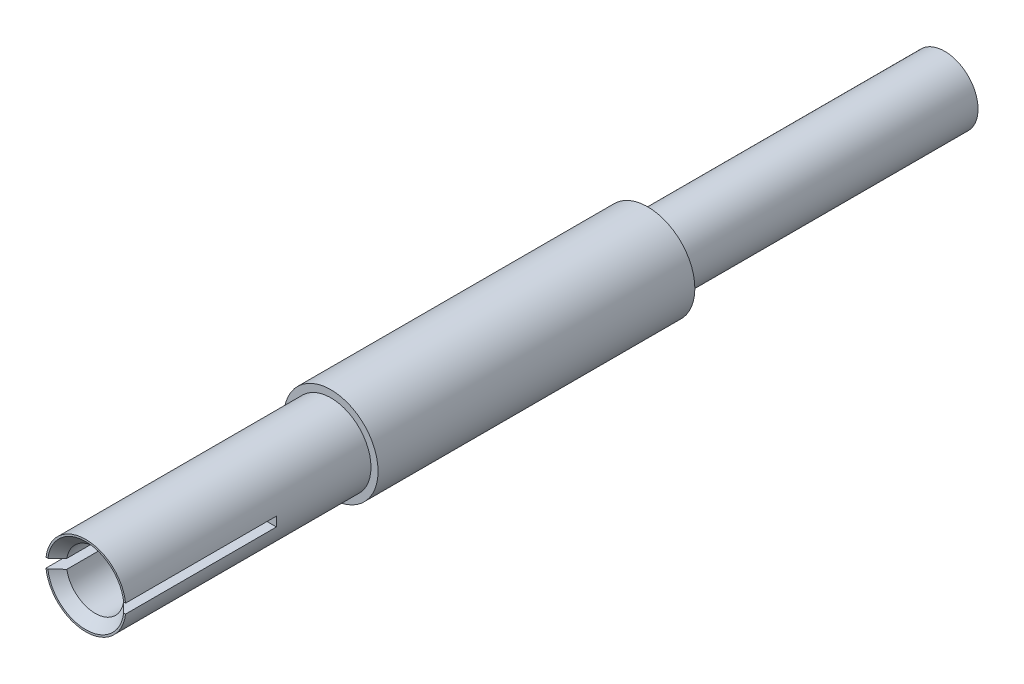
ISO-10303-21;
HEADER;
FILE_DESCRIPTION(('STEP AP214'),'2;1');
FILE_NAME('part.step','',(''),(''),'','','');
FILE_SCHEMA(('AUTOMOTIVE_DESIGN { 1 0 10303 214 1 1 1 1 }'));
ENDSEC;
DATA;
#1=APPLICATION_CONTEXT('core data for automotive mechanical design processes');
#2=APPLICATION_PROTOCOL_DEFINITION('international standard','automotive_design',2000,#1);
#3=PRODUCT_CONTEXT('',#1,'mechanical');
#4=PRODUCT('Part','Part','',(#3));
#5=PRODUCT_RELATED_PRODUCT_CATEGORY('part','',(#4));
#6=PRODUCT_DEFINITION_FORMATION('','',#4);
#7=PRODUCT_DEFINITION_CONTEXT('part definition',#1,'design');
#8=PRODUCT_DEFINITION('design','',#6,#7);
#9=PRODUCT_DEFINITION_SHAPE('','',#8);
#10=(LENGTH_UNIT() NAMED_UNIT(*) SI_UNIT(.MILLI.,.METRE.));
#11=(NAMED_UNIT(*) PLANE_ANGLE_UNIT() SI_UNIT($,.RADIAN.));
#12=(NAMED_UNIT(*) SI_UNIT($,.STERADIAN.) SOLID_ANGLE_UNIT());
#13=UNCERTAINTY_MEASURE_WITH_UNIT(LENGTH_MEASURE(1.E-05),#10,'distance_accuracy_value','');
#14=(GEOMETRIC_REPRESENTATION_CONTEXT(3) GLOBAL_UNCERTAINTY_ASSIGNED_CONTEXT((#13)) GLOBAL_UNIT_ASSIGNED_CONTEXT((#10,
#11,#12)) REPRESENTATION_CONTEXT('',''));
#15=CARTESIAN_POINT('',(0.,0.,0.));
#16=DIRECTION('',(0.,0.,1.));
#17=DIRECTION('',(1.,0.,0.));
#18=AXIS2_PLACEMENT_3D('',#15,#16,#17);
#19=CARTESIAN_POINT('',(0.,0.,3.14859999991768));
#20=DIRECTION('',(0.,0.,1.));
#21=DIRECTION('',(1.,0.,0.));
#22=AXIS2_PLACEMENT_3D('',#19,#20,#21);
#23=CONICAL_SURFACE('',#22,0.387349999925845,1.02974425864067);
#24=CARTESIAN_POINT('',(0.,0.,3.1486));
#25=DIRECTION('',(0.,0.,-1.));
#26=DIRECTION('',(-1.,0.,0.));
#27=AXIS2_PLACEMENT_3D('',#24,#25,#26);
#28=CIRCLE('',#27,0.38735);
#29=CARTESIAN_POINT('',(-0.38735,0.,3.1486));
#30=VERTEX_POINT('',#29);
#31=EDGE_CURVE('E195',#30,#30,#28,.F.);
#32=ORIENTED_EDGE('',*,*,#31,.T.);
#33=EDGE_LOOP('',(#32));
#34=FACE_BOUND('',#33,.T.);
#35=CARTESIAN_POINT('',(0.,0.,2.91585663916294));
#36=VERTEX_POINT('',#35);
#37=VERTEX_LOOP('',#36);
#38=FACE_BOUND('',#37,.T.);
#39=ADVANCED_FACE('F16',(#34,#38),#23,.F.);
#40=CARTESIAN_POINT('',(0.,0.,6.06959999998935));
#41=DIRECTION('',(0.,0.,1.));
#42=DIRECTION('',(1.,0.,0.));
#43=AXIS2_PLACEMENT_3D('',#40,#41,#42);
#44=CONICAL_SURFACE('',#43,0.514349999940683,0.78539816355156);
#45=CARTESIAN_POINT('',(0.,0.,6.06959999998935));
#46=DIRECTION('',(0.,0.,1.));
#47=DIRECTION('',(1.,0.,0.));
#48=AXIS2_PLACEMENT_3D('',#45,#46,#47);
#49=CIRCLE('',#48,0.514349999940684);
#50=CARTESIAN_POINT('',(0.510415196142739,-0.063499999999995,6.06960000000339));
#51=VERTEX_POINT('',#50);
#52=CARTESIAN_POINT('',(-0.510415196142731,-0.0635,6.06960000000339));
#53=VERTEX_POINT('',#52);
#54=EDGE_CURVE('E154',#51,#53,#49,.F.);
#55=ORIENTED_EDGE('',*,*,#54,.F.);
#56=CARTESIAN_POINT('',(0.382109634107777,-0.0635000000213032,5.94260000003275));
#57=CARTESIAN_POINT('',(0.403524698985026,-0.0635000000106516,5.96373554868005));
#58=CARTESIAN_POINT('',(0.424924362390731,-0.0635000000035505,5.98488665712628));
#59=CARTESIAN_POINT('',(0.467692883069179,-0.0634999999964495,6.02721999045916));
#60=CARTESIAN_POINT('',(0.489061740346517,-0.0634999999964495,6.04840221534116));
#61=CARTESIAN_POINT('',(0.510415196156905,-0.0635,6.06960000001745));
#62=B_SPLINE_CURVE_WITH_KNOTS('',3,(#56,#57,#58,#59,#60,#61),.UNSPECIFIED.,.F.,.F.,(4,2,4),(0.,
0.090265357925583,0.180530702386348),.UNSPECIFIED.);
#63=CARTESIAN_POINT('',(0.38210963411573,-0.0635,5.94260000002312));
#64=VERTEX_POINT('',#63);
#65=EDGE_CURVE('E162',#64,#51,#62,.T.);
#66=ORIENTED_EDGE('',*,*,#65,.F.);
#67=CARTESIAN_POINT('',(0.,0.,5.9426));
#68=DIRECTION('',(0.,0.,-1.));
#69=DIRECTION('',(-1.,0.,0.));
#70=AXIS2_PLACEMENT_3D('',#67,#68,#69);
#71=CIRCLE('',#70,0.38735);
#72=CARTESIAN_POINT('',(-0.382109634136795,-0.0635,5.94260000004411));
#73=VERTEX_POINT('',#72);
#74=EDGE_CURVE('E199',#64,#73,#71,.T.);
#75=ORIENTED_EDGE('',*,*,#74,.T.);
#76=CARTESIAN_POINT('',(-0.510415196162834,-0.0635000000092229,6.06960000001144));
#77=CARTESIAN_POINT('',(-0.489061740351425,-0.0635000000046114,6.04840221533564));
#78=CARTESIAN_POINT('',(-0.467692883071837,-0.0635000000015371,6.02721999045537));
#79=CARTESIAN_POINT('',(-0.424924362386421,-0.0634999999984629,5.98488665712845));
#80=CARTESIAN_POINT('',(-0.403524698975999,-0.0634999999984629,5.96373554868645));
#81=CARTESIAN_POINT('',(-0.382109634092802,-0.0635,5.94260000004462));
#82=B_SPLINE_CURVE_WITH_KNOTS('',3,(#76,#77,#78,#79,#80,#81),.UNSPECIFIED.,.F.,.F.,(4,2,4),(0.,
0.0902653444618959,0.180530702388632),.UNSPECIFIED.);
#83=EDGE_CURVE('E146',#53,#73,#82,.T.);
#84=ORIENTED_EDGE('',*,*,#83,.F.);
#85=EDGE_LOOP('',(#55,#66,#75,#84));
#86=FACE_BOUND('',#85,.T.);
#87=ADVANCED_FACE('F156',(#86),#44,.F.);
#88=CARTESIAN_POINT('',(0.,0.,6.0696));
#89=DIRECTION('',(0.,0.,-1.));
#90=DIRECTION('',(-1.,0.,0.));
#91=AXIS2_PLACEMENT_3D('',#88,#89,#90);
#92=CYLINDRICAL_SURFACE('',#91,0.38735);
#93=ORIENTED_EDGE('',*,*,#31,.F.);
#94=EDGE_LOOP('',(#93));
#95=FACE_BOUND('',#94,.T.);
#96=CARTESIAN_POINT('',(0.,0.,4.0376));
#97=DIRECTION('',(0.,0.,-1.));
#98=DIRECTION('',(-1.,0.,0.));
#99=AXIS2_PLACEMENT_3D('',#96,#97,#98);
#100=CIRCLE('',#99,0.38735);
#101=CARTESIAN_POINT('',(0.382109634136796,0.0634999999999999,4.0376));
#102=VERTEX_POINT('',#101);
#103=CARTESIAN_POINT('',(0.382109634136796,-0.0635000000000002,4.0376));
#104=VERTEX_POINT('',#103);
#105=EDGE_CURVE('E169',#102,#104,#100,.T.);
#106=ORIENTED_EDGE('',*,*,#105,.F.);
#107=DIRECTION('',(0.,0.,-1.));
#108=VECTOR('',#107,1.);
#109=CARTESIAN_POINT('',(0.382109634137,0.0635,6.0696));
#110=LINE('',#109,#108);
#111=CARTESIAN_POINT('',(0.382109634132592,0.0635,5.94260000008697));
#112=VERTEX_POINT('',#111);
#113=EDGE_CURVE('E186',#112,#102,#110,.T.);
#114=ORIENTED_EDGE('',*,*,#113,.F.);
#115=CARTESIAN_POINT('',(0.,0.,5.94260000008262));
#116=DIRECTION('',(0.,0.,1.));
#117=DIRECTION('',(0.986471238258404,0.163934426185997,0.));
#118=AXIS2_PLACEMENT_3D('',#115,#116,#117);
#119=CIRCLE('',#118,0.387349999991702);
#120=CARTESIAN_POINT('',(-0.382109634126001,0.0635,5.94260000007612));
#121=VERTEX_POINT('',#120);
#122=EDGE_CURVE('E102',#112,#121,#119,.T.);
#123=ORIENTED_EDGE('',*,*,#122,.T.);
#124=DIRECTION('',(0.,0.,-1.));
#125=VECTOR('',#124,1.);
#126=CARTESIAN_POINT('',(-0.382109634137,0.0635,6.0696));
#127=LINE('',#126,#125);
#128=CARTESIAN_POINT('',(-0.382109634136796,0.0634999999999998,4.0376));
#129=VERTEX_POINT('',#128);
#130=EDGE_CURVE('E114',#129,#121,#127,.F.);
#131=ORIENTED_EDGE('',*,*,#130,.F.);
#132=CARTESIAN_POINT('',(0.,0.,4.0376));
#133=DIRECTION('',(0.,0.,-1.));
#134=DIRECTION('',(-1.,0.,0.));
#135=AXIS2_PLACEMENT_3D('',#132,#133,#134);
#136=CIRCLE('',#135,0.38735);
#137=CARTESIAN_POINT('',(-0.382109634136795,-0.0635000000000001,4.0376));
#138=VERTEX_POINT('',#137);
#139=EDGE_CURVE('E110',#138,#129,#136,.T.);
#140=ORIENTED_EDGE('',*,*,#139,.F.);
#141=DIRECTION('',(0.,0.,1.));
#142=VECTOR('',#141,1.);
#143=CARTESIAN_POINT('',(-0.382109634137,-0.0635,6.0696));
#144=LINE('',#143,#142);
#145=EDGE_CURVE('E152',#73,#138,#144,.F.);
#146=ORIENTED_EDGE('',*,*,#145,.F.);
#147=ORIENTED_EDGE('',*,*,#74,.F.);
#148=DIRECTION('',(0.,0.,1.));
#149=VECTOR('',#148,1.);
#150=CARTESIAN_POINT('',(0.382109634137,-0.0635,6.0696));
#151=LINE('',#150,#149);
#152=EDGE_CURVE('E168',#104,#64,#151,.T.);
#153=ORIENTED_EDGE('',*,*,#152,.F.);
#154=EDGE_LOOP('',(#106,#114,#123,#131,#140,#146,#147,#153));
#155=FACE_BOUND('',#154,.T.);
#156=ADVANCED_FACE('F159',(#95,#155),#92,.F.);
#157=CARTESIAN_POINT('',(0.,0.,6.06960000004619));
#158=DIRECTION('',(0.,0.,1.));
#159=DIRECTION('',(0.,-1.,0.));
#160=AXIS2_PLACEMENT_3D('',#157,#158,#159);
#161=CONICAL_SURFACE('',#160,0.51434999999442,0.78539816355156);
#162=CARTESIAN_POINT('',(0.,0.,6.06960000004619));
#163=DIRECTION('',(0.,0.,1.));
#164=DIRECTION('',(0.,-1.,0.));
#165=AXIS2_PLACEMENT_3D('',#162,#163,#164);
#166=CIRCLE('',#165,0.514349999994419);
#167=CARTESIAN_POINT('',(-0.510415196159456,0.0635,6.0696000000231));
#168=VERTEX_POINT('',#167);
#169=CARTESIAN_POINT('',(0.510415196174565,0.0635,6.06960000003808));
#170=VERTEX_POINT('',#169);
#171=EDGE_CURVE('E19',#168,#170,#166,.F.);
#172=ORIENTED_EDGE('',*,*,#171,.F.);
#173=CARTESIAN_POINT('',(-0.382109634122112,0.0635000000113739,5.94260000006242));
#174=CARTESIAN_POINT('',(-0.403524699001302,0.0635000000056869,5.96373554870546));
#175=CARTESIAN_POINT('',(-0.424924362407916,0.0635000000018957,5.98488665714846));
#176=CARTESIAN_POINT('',(-0.467692883086116,0.0634999999981044,6.02721999047699));
#177=CARTESIAN_POINT('',(-0.489061740362296,0.0634999999981044,6.04840221535786));
#178=CARTESIAN_POINT('',(-0.510415196170496,0.0635,6.06960000003405));
#179=B_SPLINE_CURVE_WITH_KNOTS('',3,(#173,#174,#175,#176,#177,#178),.UNSPECIFIED.,.F.,.F.,(4,2,
4),(0.,0.0902653579207298,0.180530702376633),.UNSPECIFIED.);
#180=EDGE_CURVE('E95',#121,#168,#179,.T.);
#181=ORIENTED_EDGE('',*,*,#180,.F.);
#182=ORIENTED_EDGE('',*,*,#122,.F.);
#183=CARTESIAN_POINT('',(0.510415196173183,0.0635000000105243,6.06960000002313));
#184=CARTESIAN_POINT('',(0.489061740361113,0.0635000000052622,6.04840221534751));
#185=CARTESIAN_POINT('',(0.467692883081003,0.0635000000017541,6.02721999046727));
#186=CARTESIAN_POINT('',(0.424924362394825,0.0634999999982459,5.98488665714014));
#187=CARTESIAN_POINT('',(0.403524698984162,0.0634999999982459,5.96373554869789));
#188=CARTESIAN_POINT('',(0.382109634100865,0.0635,5.94260000005567));
#189=B_SPLINE_CURVE_WITH_KNOTS('',3,(#183,#184,#185,#186,#187,#188),.UNSPECIFIED.,.F.,.F.,(4,2,
4),(0.,0.0902653444629319,0.180530702390704),.UNSPECIFIED.);
#190=EDGE_CURVE('E98',#170,#112,#189,.T.);
#191=ORIENTED_EDGE('',*,*,#190,.F.);
#192=EDGE_LOOP('',(#172,#181,#182,#191));
#193=FACE_BOUND('',#192,.T.);
#194=ADVANCED_FACE('F93',(#193),#161,.F.);
#195=CARTESIAN_POINT('',(0.,0.,6.0696));
#196=DIRECTION('',(0.,0.,1.));
#197=DIRECTION('',(1.,0.,0.));
#198=AXIS2_PLACEMENT_3D('',#195,#196,#197);
#199=PLANE('',#198);
#200=DIRECTION('',(1.,0.,0.));
#201=VECTOR('',#200,1.);
#202=CARTESIAN_POINT('',(-0.635,0.0635,6.0696));
#203=LINE('',#202,#201);
#204=CARTESIAN_POINT('',(-0.536001690762257,0.0635000000000151,6.0696));
#205=VERTEX_POINT('',#204);
#206=EDGE_CURVE('E104',#168,#205,#203,.F.);
#207=ORIENTED_EDGE('',*,*,#206,.F.);
#208=ORIENTED_EDGE('',*,*,#171,.T.);
#209=DIRECTION('',(1.,0.,0.));
#210=VECTOR('',#209,1.);
#211=CARTESIAN_POINT('',(-0.635,0.0635,6.0696));
#212=LINE('',#211,#210);
#213=CARTESIAN_POINT('',(0.536001690762258,0.0635000000000102,6.0696));
#214=VERTEX_POINT('',#213);
#215=EDGE_CURVE('E101',#214,#170,#212,.F.);
#216=ORIENTED_EDGE('',*,*,#215,.F.);
#217=CARTESIAN_POINT('',(0.,0.,6.0696));
#218=DIRECTION('',(0.,0.,1.));
#219=DIRECTION('',(1.,0.,0.));
#220=AXIS2_PLACEMENT_3D('',#217,#218,#219);
#221=CIRCLE('',#220,0.53975);
#222=EDGE_CURVE('E107',#205,#214,#221,.F.);
#223=ORIENTED_EDGE('',*,*,#222,.F.);
#224=EDGE_LOOP('',(#207,#208,#216,#223));
#225=FACE_BOUND('',#224,.T.);
#226=ADVANCED_FACE('F105',(#225),#199,.T.);
#227=CARTESIAN_POINT('',(-0.635,0.0635,6.0696));
#228=DIRECTION('',(0.,-1.,0.));
#229=DIRECTION('',(0.,0.,-1.));
#230=AXIS2_PLACEMENT_3D('',#227,#228,#229);
#231=PLANE('',#230);
#232=DIRECTION('',(1.,0.,0.));
#233=VECTOR('',#232,1.);
#234=CARTESIAN_POINT('',(0.,0.0635,4.0376));
#235=LINE('',#234,#233);
#236=CARTESIAN_POINT('',(0.536001690762257,0.0635000000000101,4.0376));
#237=VERTEX_POINT('',#236);
#238=EDGE_CURVE('E188',#237,#102,#235,.F.);
#239=ORIENTED_EDGE('',*,*,#238,.F.);
#240=DIRECTION('',(0.,0.,1.));
#241=VECTOR('',#240,1.);
#242=CARTESIAN_POINT('',(0.536001690762255,0.0635000000000202,2.7676));
#243=LINE('',#242,#241);
#244=EDGE_CURVE('E116',#214,#237,#243,.F.);
#245=ORIENTED_EDGE('',*,*,#244,.F.);
#246=ORIENTED_EDGE('',*,*,#215,.T.);
#247=ORIENTED_EDGE('',*,*,#190,.T.);
#248=ORIENTED_EDGE('',*,*,#113,.T.);
#249=EDGE_LOOP('',(#239,#245,#246,#247,#248));
#250=FACE_BOUND('',#249,.T.);
#251=ADVANCED_FACE('F178',(#250),#231,.T.);
#252=CARTESIAN_POINT('',(0.,0.,4.0376));
#253=DIRECTION('',(0.,0.,1.));
#254=DIRECTION('',(1.,0.,0.));
#255=AXIS2_PLACEMENT_3D('',#252,#253,#254);
#256=PLANE('',#255);
#257=CARTESIAN_POINT('',(0.,0.,4.0376));
#258=DIRECTION('',(0.,0.,1.));
#259=DIRECTION('',(1.,0.,0.));
#260=AXIS2_PLACEMENT_3D('',#257,#258,#259);
#261=CIRCLE('',#260,0.53975);
#262=CARTESIAN_POINT('',(0.536001690762256,-0.0635000000000152,4.0376));
#263=VERTEX_POINT('',#262);
#264=EDGE_CURVE('E225',#237,#263,#261,.F.);
#265=ORIENTED_EDGE('',*,*,#264,.F.);
#266=ORIENTED_EDGE('',*,*,#238,.T.);
#267=ORIENTED_EDGE('',*,*,#105,.T.);
#268=DIRECTION('',(1.,0.,0.));
#269=VECTOR('',#268,1.);
#270=CARTESIAN_POINT('',(0.635,-0.0635000000000002,4.0376));
#271=LINE('',#270,#269);
#272=EDGE_CURVE('E204',#263,#104,#271,.F.);
#273=ORIENTED_EDGE('',*,*,#272,.F.);
#274=EDGE_LOOP('',(#265,#266,#267,#273));
#275=FACE_BOUND('',#274,.T.);
#276=ADVANCED_FACE('F174',(#275),#256,.T.);
#277=CARTESIAN_POINT('',(0.635,-0.0635,6.0696));
#278=DIRECTION('',(0.,1.,0.));
#279=DIRECTION('',(0.,0.,1.));
#280=AXIS2_PLACEMENT_3D('',#277,#278,#279);
#281=PLANE('',#280);
#282=ORIENTED_EDGE('',*,*,#152,.T.);
#283=ORIENTED_EDGE('',*,*,#65,.T.);
#284=DIRECTION('',(1.,0.,0.));
#285=VECTOR('',#284,1.);
#286=CARTESIAN_POINT('',(0.,-0.06349999999999,6.0696));
#287=LINE('',#286,#285);
#288=CARTESIAN_POINT('',(0.536001690762258,-0.0635000000000101,6.0696));
#289=VERTEX_POINT('',#288);
#290=EDGE_CURVE('E167',#289,#51,#287,.F.);
#291=ORIENTED_EDGE('',*,*,#290,.F.);
#292=DIRECTION('',(0.,0.,1.));
#293=VECTOR('',#292,1.);
#294=CARTESIAN_POINT('',(0.536001690762254,-0.0635000000000303,2.7676));
#295=LINE('',#294,#293);
#296=EDGE_CURVE('E224',#263,#289,#295,.T.);
#297=ORIENTED_EDGE('',*,*,#296,.F.);
#298=ORIENTED_EDGE('',*,*,#272,.T.);
#299=EDGE_LOOP('',(#282,#283,#291,#297,#298));
#300=FACE_BOUND('',#299,.T.);
#301=ADVANCED_FACE('F170',(#300),#281,.T.);
#302=CARTESIAN_POINT('',(0.,0.,6.0696));
#303=DIRECTION('',(0.,0.,1.));
#304=DIRECTION('',(1.,0.,0.));
#305=AXIS2_PLACEMENT_3D('',#302,#303,#304);
#306=PLANE('',#305);
#307=ORIENTED_EDGE('',*,*,#290,.T.);
#308=ORIENTED_EDGE('',*,*,#54,.T.);
#309=DIRECTION('',(1.,0.,0.));
#310=VECTOR('',#309,1.);
#311=CARTESIAN_POINT('',(0.635,-0.0635,6.0696));
#312=LINE('',#311,#310);
#313=CARTESIAN_POINT('',(-0.536001690762258,-0.0635000000000051,6.0696));
#314=VERTEX_POINT('',#313);
#315=EDGE_CURVE('E153',#314,#53,#312,.T.);
#316=ORIENTED_EDGE('',*,*,#315,.F.);
#317=CARTESIAN_POINT('',(0.,0.,6.0696));
#318=DIRECTION('',(0.,0.,1.));
#319=DIRECTION('',(1.,0.,0.));
#320=AXIS2_PLACEMENT_3D('',#317,#318,#319);
#321=CIRCLE('',#320,0.53975);
#322=EDGE_CURVE('E222',#289,#314,#321,.F.);
#323=ORIENTED_EDGE('',*,*,#322,.F.);
#324=EDGE_LOOP('',(#307,#308,#316,#323));
#325=FACE_BOUND('',#324,.T.);
#326=ADVANCED_FACE('F143',(#325),#306,.T.);
#327=CARTESIAN_POINT('',(0.635,-0.0635,6.0696));
#328=DIRECTION('',(0.,1.,0.));
#329=DIRECTION('',(0.,0.,1.));
#330=AXIS2_PLACEMENT_3D('',#327,#328,#329);
#331=PLANE('',#330);
#332=DIRECTION('',(1.,0.,0.));
#333=VECTOR('',#332,1.);
#334=CARTESIAN_POINT('',(0.,-0.0635,4.0376));
#335=LINE('',#334,#333);
#336=CARTESIAN_POINT('',(-0.536001690762259,-0.0635000000000052,4.0376));
#337=VERTEX_POINT('',#336);
#338=EDGE_CURVE('E201',#337,#138,#335,.T.);
#339=ORIENTED_EDGE('',*,*,#338,.F.);
#340=DIRECTION('',(0.,0.,1.));
#341=VECTOR('',#340,1.);
#342=CARTESIAN_POINT('',(-0.536001690762258,-0.0635000000000104,2.7676));
#343=LINE('',#342,#341);
#344=EDGE_CURVE('E221',#314,#337,#343,.F.);
#345=ORIENTED_EDGE('',*,*,#344,.F.);
#346=ORIENTED_EDGE('',*,*,#315,.T.);
#347=ORIENTED_EDGE('',*,*,#83,.T.);
#348=ORIENTED_EDGE('',*,*,#145,.T.);
#349=EDGE_LOOP('',(#339,#345,#346,#347,#348));
#350=FACE_BOUND('',#349,.T.);
#351=ADVANCED_FACE('F139',(#350),#331,.T.);
#352=CARTESIAN_POINT('',(0.,0.,4.0376));
#353=DIRECTION('',(0.,0.,1.));
#354=DIRECTION('',(1.,0.,0.));
#355=AXIS2_PLACEMENT_3D('',#352,#353,#354);
#356=PLANE('',#355);
#357=ORIENTED_EDGE('',*,*,#338,.T.);
#358=ORIENTED_EDGE('',*,*,#139,.T.);
#359=DIRECTION('',(1.,0.,0.));
#360=VECTOR('',#359,1.);
#361=CARTESIAN_POINT('',(-0.635,0.0634999999999998,4.0376));
#362=LINE('',#361,#360);
#363=CARTESIAN_POINT('',(-0.536001690762257,0.063500000000015,4.0376));
#364=VERTEX_POINT('',#363);
#365=EDGE_CURVE('E34',#364,#129,#362,.T.);
#366=ORIENTED_EDGE('',*,*,#365,.F.);
#367=CARTESIAN_POINT('',(0.,0.,4.0376));
#368=DIRECTION('',(0.,0.,1.));
#369=DIRECTION('',(1.,0.,0.));
#370=AXIS2_PLACEMENT_3D('',#367,#368,#369);
#371=CIRCLE('',#370,0.53975);
#372=EDGE_CURVE('E218',#337,#364,#371,.F.);
#373=ORIENTED_EDGE('',*,*,#372,.F.);
#374=EDGE_LOOP('',(#357,#358,#366,#373));
#375=FACE_BOUND('',#374,.T.);
#376=ADVANCED_FACE('F135',(#375),#356,.T.);
#377=CARTESIAN_POINT('',(-0.635,0.0635,6.0696));
#378=DIRECTION('',(0.,-1.,0.));
#379=DIRECTION('',(0.,0.,-1.));
#380=AXIS2_PLACEMENT_3D('',#377,#378,#379);
#381=PLANE('',#380);
#382=ORIENTED_EDGE('',*,*,#130,.T.);
#383=ORIENTED_EDGE('',*,*,#180,.T.);
#384=ORIENTED_EDGE('',*,*,#206,.T.);
#385=DIRECTION('',(0.,0.,1.));
#386=VECTOR('',#385,1.);
#387=CARTESIAN_POINT('',(-0.536001690762256,0.0635000000000301,2.7676));
#388=LINE('',#387,#386);
#389=EDGE_CURVE('E217',#364,#205,#388,.T.);
#390=ORIENTED_EDGE('',*,*,#389,.F.);
#391=ORIENTED_EDGE('',*,*,#365,.T.);
#392=EDGE_LOOP('',(#382,#383,#384,#390,#391));
#393=FACE_BOUND('',#392,.T.);
#394=ADVANCED_FACE('F112',(#393),#381,.T.);
#395=CARTESIAN_POINT('',(0.,0.,-5.5));
#396=DIRECTION('',(0.,0.,-1.));
#397=DIRECTION('',(-1.,0.,0.));
#398=AXIS2_PLACEMENT_3D('',#395,#396,#397);
#399=PLANE('',#398);
#400=CARTESIAN_POINT('',(0.,0.,-5.5));
#401=DIRECTION('',(0.,0.,-1.));
#402=DIRECTION('',(-1.,0.,0.));
#403=AXIS2_PLACEMENT_3D('',#400,#401,#402);
#404=CIRCLE('',#403,0.45);
#405=CARTESIAN_POINT('',(-0.450000000000007,0.,-5.5));
#406=VERTEX_POINT('',#405);
#407=EDGE_CURVE('E214',#406,#406,#404,.F.);
#408=ORIENTED_EDGE('',*,*,#407,.F.);
#409=EDGE_LOOP('',(#408));
#410=FACE_BOUND('',#409,.T.);
#411=ADVANCED_FACE('F134',(#410),#399,.T.);
#412=CARTESIAN_POINT('',(0.,0.,2.7676));
#413=DIRECTION('',(0.,0.,1.));
#414=DIRECTION('',(1.,0.,0.));
#415=AXIS2_PLACEMENT_3D('',#412,#413,#414);
#416=CYLINDRICAL_SURFACE('',#415,0.53975);
#417=CARTESIAN_POINT('',(0.,0.,2.7676));
#418=DIRECTION('',(0.,0.,1.));
#419=DIRECTION('',(1.,0.,0.));
#420=AXIS2_PLACEMENT_3D('',#417,#418,#419);
#421=CIRCLE('',#420,0.53975);
#422=CARTESIAN_POINT('',(0.539749999999999,0.,2.7676));
#423=VERTEX_POINT('',#422);
#424=EDGE_CURVE('E211',#423,#423,#421,.F.);
#425=ORIENTED_EDGE('',*,*,#424,.F.);
#426=EDGE_LOOP('',(#425));
#427=FACE_BOUND('',#426,.T.);
#428=ORIENTED_EDGE('',*,*,#372,.T.);
#429=ORIENTED_EDGE('',*,*,#389,.T.);
#430=ORIENTED_EDGE('',*,*,#222,.T.);
#431=ORIENTED_EDGE('',*,*,#244,.T.);
#432=ORIENTED_EDGE('',*,*,#264,.T.);
#433=ORIENTED_EDGE('',*,*,#296,.T.);
#434=ORIENTED_EDGE('',*,*,#322,.T.);
#435=ORIENTED_EDGE('',*,*,#344,.T.);
#436=EDGE_LOOP('',(#428,#429,#430,#431,#432,#433,#434,#435));
#437=FACE_BOUND('',#436,.T.);
#438=ADVANCED_FACE('F231',(#427,#437),#416,.T.);
#439=CARTESIAN_POINT('',(0.,0.,-1.5));
#440=DIRECTION('',(0.,0.,-1.));
#441=DIRECTION('',(-1.,0.,0.));
#442=AXIS2_PLACEMENT_3D('',#439,#440,#441);
#443=CYLINDRICAL_SURFACE('',#442,0.45);
#444=CARTESIAN_POINT('',(0.,0.,-1.5));
#445=DIRECTION('',(0.,0.,-1.));
#446=DIRECTION('',(-1.,0.,0.));
#447=AXIS2_PLACEMENT_3D('',#444,#445,#446);
#448=CIRCLE('',#447,0.45);
#449=CARTESIAN_POINT('',(-0.450000000000005,0.,-1.5));
#450=VERTEX_POINT('',#449);
#451=EDGE_CURVE('E208',#450,#450,#448,.T.);
#452=ORIENTED_EDGE('',*,*,#451,.T.);
#453=EDGE_LOOP('',(#452));
#454=FACE_BOUND('',#453,.T.);
#455=ORIENTED_EDGE('',*,*,#407,.T.);
#456=EDGE_LOOP('',(#455));
#457=FACE_BOUND('',#456,.T.);
#458=ADVANCED_FACE('F277',(#454,#457),#443,.T.);
#459=CARTESIAN_POINT('',(0.,0.,2.7676));
#460=DIRECTION('',(0.,0.,1.));
#461=DIRECTION('',(1.,0.,0.));
#462=AXIS2_PLACEMENT_3D('',#459,#460,#461);
#463=PLANE('',#462);
#464=ORIENTED_EDGE('',*,*,#424,.T.);
#465=EDGE_LOOP('',(#464));
#466=FACE_BOUND('',#465,.T.);
#467=CARTESIAN_POINT('',(0.,0.,2.7676));
#468=DIRECTION('',(0.,0.,1.));
#469=DIRECTION('',(1.,0.,0.));
#470=AXIS2_PLACEMENT_3D('',#467,#468,#469);
#471=CIRCLE('',#470,0.635);
#472=CARTESIAN_POINT('',(0.634999999999996,0.,2.7676));
#473=VERTEX_POINT('',#472);
#474=EDGE_CURVE('E25',#473,#473,#471,.F.);
#475=ORIENTED_EDGE('',*,*,#474,.F.);
#476=EDGE_LOOP('',(#475));
#477=FACE_BOUND('',#476,.T.);
#478=ADVANCED_FACE('F270',(#466,#477),#463,.T.);
#479=CARTESIAN_POINT('',(0.,0.,-1.5));
#480=DIRECTION('',(0.,0.,1.));
#481=DIRECTION('',(1.,0.,0.));
#482=AXIS2_PLACEMENT_3D('',#479,#480,#481);
#483=PLANE('',#482);
#484=ORIENTED_EDGE('',*,*,#451,.F.);
#485=EDGE_LOOP('',(#484));
#486=FACE_BOUND('',#485,.T.);
#487=CARTESIAN_POINT('',(0.,0.,-1.5));
#488=DIRECTION('',(0.,0.,1.));
#489=DIRECTION('',(1.,0.,0.));
#490=AXIS2_PLACEMENT_3D('',#487,#488,#489);
#491=CIRCLE('',#490,0.635);
#492=CARTESIAN_POINT('',(0.634999999999995,0.,-1.5));
#493=VERTEX_POINT('',#492);
#494=EDGE_CURVE('E10',#493,#493,#491,.T.);
#495=ORIENTED_EDGE('',*,*,#494,.F.);
#496=EDGE_LOOP('',(#495));
#497=FACE_BOUND('',#496,.T.);
#498=ADVANCED_FACE('F264',(#486,#497),#483,.F.);
#499=CARTESIAN_POINT('',(0.,0.,-1.5));
#500=DIRECTION('',(0.,0.,1.));
#501=DIRECTION('',(1.,0.,0.));
#502=AXIS2_PLACEMENT_3D('',#499,#500,#501);
#503=CYLINDRICAL_SURFACE('',#502,0.635);
#504=ORIENTED_EDGE('',*,*,#494,.T.);
#505=EDGE_LOOP('',(#504));
#506=FACE_BOUND('',#505,.T.);
#507=ORIENTED_EDGE('',*,*,#474,.T.);
#508=EDGE_LOOP('',(#507));
#509=FACE_BOUND('',#508,.T.);
#510=ADVANCED_FACE('F262',(#506,#509),#503,.T.);
#511=CLOSED_SHELL('',(#39,#87,#156,#194,#226,#251,#276,#301,#326,#351,#376,#394,#411,#438,#458,
#478,#498,#510));
#512=MANIFOLD_SOLID_BREP('B1',#511);
#513=ADVANCED_BREP_SHAPE_REPRESENTATION('',(#18,#512),#14);
#514=SHAPE_DEFINITION_REPRESENTATION(#9,#513);
ENDSEC;
END-ISO-10303-21;
